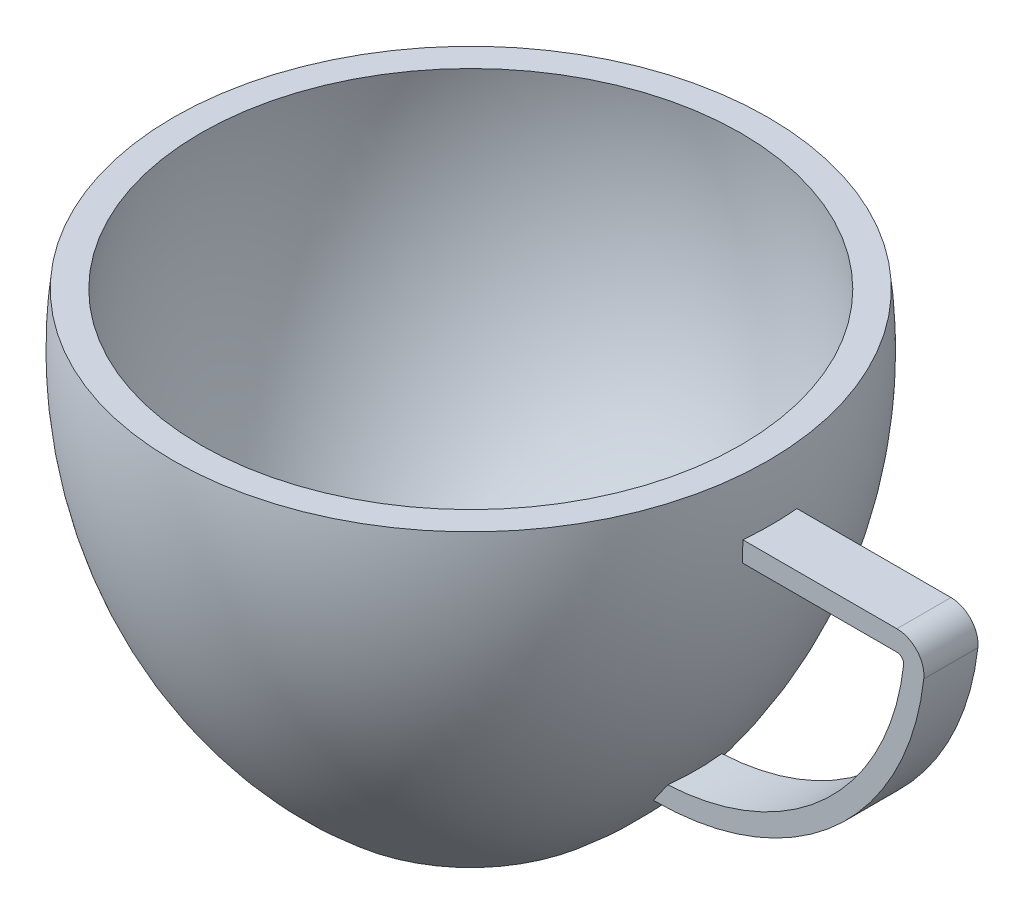
ISO-10303-21;
HEADER;
FILE_DESCRIPTION(('STEP AP214'),'2;1');
FILE_NAME('part.step','',(''),(''),'','','');
FILE_SCHEMA(('AUTOMOTIVE_DESIGN { 1 0 10303 214 1 1 1 1 }'));
ENDSEC;
DATA;
#1=APPLICATION_CONTEXT('core data for automotive mechanical design processes');
#2=APPLICATION_PROTOCOL_DEFINITION('international standard','automotive_design',2000,#1);
#3=PRODUCT_CONTEXT('',#1,'mechanical');
#4=PRODUCT('Part','Part','',(#3));
#5=PRODUCT_RELATED_PRODUCT_CATEGORY('part','',(#4));
#6=PRODUCT_DEFINITION_FORMATION('','',#4);
#7=PRODUCT_DEFINITION_CONTEXT('part definition',#1,'design');
#8=PRODUCT_DEFINITION('design','',#6,#7);
#9=PRODUCT_DEFINITION_SHAPE('','',#8);
#10=(LENGTH_UNIT() NAMED_UNIT(*) SI_UNIT(.MILLI.,.METRE.));
#11=(NAMED_UNIT(*) PLANE_ANGLE_UNIT() SI_UNIT($,.RADIAN.));
#12=(NAMED_UNIT(*) SI_UNIT($,.STERADIAN.) SOLID_ANGLE_UNIT());
#13=UNCERTAINTY_MEASURE_WITH_UNIT(LENGTH_MEASURE(1.E-05),#10,'distance_accuracy_value','');
#14=(GEOMETRIC_REPRESENTATION_CONTEXT(3) GLOBAL_UNCERTAINTY_ASSIGNED_CONTEXT((#13)) GLOBAL_UNIT_ASSIGNED_CONTEXT((#10,
#11,#12)) REPRESENTATION_CONTEXT('',''));
#15=CARTESIAN_POINT('',(0.,0.,0.));
#16=DIRECTION('',(0.,0.,1.));
#17=DIRECTION('',(1.,0.,0.));
#18=AXIS2_PLACEMENT_3D('',#15,#16,#17);
#19=CARTESIAN_POINT('',(0.,13.0553639813713,0.));
#20=DIRECTION('',(0.,-1.,0.));
#21=DIRECTION('',(0.,0.,-1.));
#22=AXIS2_PLACEMENT_3D('',#19,#20,#21);
#23=DEGENERATE_TOROIDAL_SURFACE('',#22,5.88840995342818,17.,.F.);
#24=CARTESIAN_POINT('',(7.30077248417855,23.696917832123,1.));
#25=CARTESIAN_POINT('',(7.59952083440758,23.3282349060073,1.));
#26=CARTESIAN_POINT('',(7.88257192245152,22.9468891533379,1.));
#27=CARTESIAN_POINT('',(8.41551795262124,22.161730402686,1.));
#28=CARTESIAN_POINT('',(8.66541525257299,21.7579190053139,1.));
#29=CARTESIAN_POINT('',(9.13013885620713,20.9309832917285,1.));
#30=CARTESIAN_POINT('',(9.34499458834599,20.5078755670458,1.));
#31=CARTESIAN_POINT('',(9.63999120526881,19.8609382677927,1.));
#32=CARTESIAN_POINT('',(9.73377916187765,19.6432365469166,1.));
#33=CARTESIAN_POINT('',(9.91214777716445,19.2040273336014,1.));
#34=CARTESIAN_POINT('',(9.99672608389787,18.982518885651,1.));
#35=CARTESIAN_POINT('',(10.236477264824,18.3126683996781,1.));
#36=CARTESIAN_POINT('',(10.3775736268376,17.8592047369365,1.));
#37=CARTESIAN_POINT('',(10.6211601230186,16.9420242494255,1.));
#38=CARTESIAN_POINT('',(10.7236502059755,16.4783074110563,1.));
#39=CARTESIAN_POINT('',(10.8479020955305,15.7775925563018,1.));
#40=CARTESIAN_POINT('',(10.8844087263413,15.5431294008161,1.));
#41=CARTESIAN_POINT('',(10.9475307104827,15.0729376622215,1.));
#42=CARTESIAN_POINT('',(10.974148586066,14.8372094173724,1.));
#43=CARTESIAN_POINT('',(11.0391041157384,14.1286173967237,1.));
#44=CARTESIAN_POINT('',(11.0625515575804,13.6543018350093,1.));
#45=CARTESIAN_POINT('',(11.0695447374267,12.7039587862581,1.));
#46=CARTESIAN_POINT('',(11.052965920939,12.2279305699943,1.));
#47=CARTESIAN_POINT('',(10.9797730680935,11.2789434590875,1.));
#48=CARTESIAN_POINT('',(10.9231588360427,10.8059845794587,1.));
#49=CARTESIAN_POINT('',(10.7703054307952,9.86662094214809,1.));
#50=CARTESIAN_POINT('',(10.6740746582702,9.40021481662722,1.));
#51=CARTESIAN_POINT('',(10.4426643360945,8.4771687178842,1.));
#52=CARTESIAN_POINT('',(10.307485036271,8.02052868203966,1.));
#53=CARTESIAN_POINT('',(9.99919003099215,7.12046109096867,1.));
#54=CARTESIAN_POINT('',(9.82609083080824,6.67702788234679,1.));
#55=CARTESIAN_POINT('',(9.44312624110045,5.80632154025281,1.));
#56=CARTESIAN_POINT('',(9.23326013998763,5.37904871974454,1.));
#57=CARTESIAN_POINT('',(8.77791778242741,4.54317245904872,1.));
#58=CARTESIAN_POINT('',(8.53239413576723,4.13459483099434,1.));
#59=CARTESIAN_POINT('',(8.00766882910043,3.33970621380463,1.));
#60=CARTESIAN_POINT('',(7.72846928635782,2.95339382706814,1.));
#61=CARTESIAN_POINT('',(7.13847459869935,2.20607005377405,1.));
#62=CARTESIAN_POINT('',(6.82769874895184,1.84504344114076,1.));
#63=CARTESIAN_POINT('',(6.17645110554574,1.15070607368025,1.));
#64=CARTESIAN_POINT('',(5.83597230816754,0.817401891969589,1.));
#65=CARTESIAN_POINT('',(5.12895362690315,0.18253215559642,1.));
#66=CARTESIAN_POINT('',(4.76252350960286,-0.119155096026248,1.));
#67=CARTESIAN_POINT('',(4.19432413785789,-0.546566062014832,1.));
#68=CARTESIAN_POINT('',(4.00187072838982,-0.684825585846648,1.));
#69=CARTESIAN_POINT('',(3.61095182299595,-0.952547586039068,1.));
#70=CARTESIAN_POINT('',(3.41248733350122,-1.08201152339539,1.));
#71=CARTESIAN_POINT('',(3.07367758736998,-1.29185019407373,1.));
#72=CARTESIAN_POINT('',(2.93489315775723,-1.37475645255763,1.));
#73=CARTESIAN_POINT('',(2.6546023972089,-1.53583567682707,1.));
#74=CARTESIAN_POINT('',(2.51309617982307,-1.61400883950981,1.));
#75=CARTESIAN_POINT('',(2.22668532019009,-1.76543257271358,1.));
#76=CARTESIAN_POINT('',(2.08176861233274,-1.83866035368695,1.));
#77=CARTESIAN_POINT('',(1.78896847151265,-1.97890896755457,1.));
#78=CARTESIAN_POINT('',(1.64108570320917,-2.04593117255011,1.));
#79=CARTESIAN_POINT('',(1.40175161897428,-2.14664876863682,1.));
#80=CARTESIAN_POINT('',(1.31139751655248,-2.18294852778397,1.));
#81=CARTESIAN_POINT('',(1.12928508571877,-2.25181415852131,1.));
#82=CARTESIAN_POINT('',(1.03752709984784,-2.2843809249812,1.));
#83=CARTESIAN_POINT('',(0.853128632707883,-2.34424239735785,1.));
#84=CARTESIAN_POINT('',(0.760501934866983,-2.37157888760958,1.));
#85=CARTESIAN_POINT('',(0.573429199876512,-2.41920484681435,1.));
#86=CARTESIAN_POINT('',(0.478984187164986,-2.439498167952,1.));
#87=CARTESIAN_POINT('',(0.308581230659268,-2.46687648123689,1.));
#88=CARTESIAN_POINT('',(0.232936204022655,-2.47584687972702,1.));
#89=CARTESIAN_POINT('',(0.0811560262776345,-2.48629440331269,1.));
#90=CARTESIAN_POINT('',(0.00502126724677077,-2.48777691858447,1.));
#91=CARTESIAN_POINT('',(-0.147258877175811,-2.48300121892752,1.));
#92=CARTESIAN_POINT('',(-0.223403363894557,-2.47671584562317,1.));
#93=CARTESIAN_POINT('',(-0.374847972516725,-2.45734615858675,1.));
#94=CARTESIAN_POINT('',(-0.450147305380438,-2.44425595671639,1.));
#95=CARTESIAN_POINT('',(-0.615750770504337,-2.40938324519143,1.));
#96=CARTESIAN_POINT('',(-0.705780908854443,-2.38633361058506,1.));
#97=CARTESIAN_POINT('',(-0.884265620633698,-2.33470268860218,1.));
#98=CARTESIAN_POINT('',(-0.972718950361583,-2.30611722887742,1.));
#99=CARTESIAN_POINT('',(-1.14840070648424,-2.24486925955854,1.));
#100=CARTESIAN_POINT('',(-1.23562607025081,-2.21219806669902,1.));
#101=CARTESIAN_POINT('',(-1.40881599856753,-2.14376809508477,1.));
#102=CARTESIAN_POINT('',(-1.49478094194235,-2.10801026724721,1.));
#103=CARTESIAN_POINT('',(-1.66652534860595,-2.03357312269801,1.));
#104=CARTESIAN_POINT('',(-1.75229300458023,-1.99486666068911,1.));
#105=CARTESIAN_POINT('',(-1.92279712624196,-1.91524117380599,1.));
#106=CARTESIAN_POINT('',(-2.0075335182167,-1.87432199189564,1.));
#107=CARTESIAN_POINT('',(-2.26003881615724,-1.74874843082098,1.));
#108=CARTESIAN_POINT('',(-2.42636135232311,-1.66116455766798,1.));
#109=CARTESIAN_POINT('',(-2.65847650303473,-1.53285615075187,1.));
#110=CARTESIAN_POINT('',(-2.72581959625385,-1.49489304711488,1.));
#111=CARTESIAN_POINT('',(-2.85989700748074,-1.41787037298937,1.));
#112=CARTESIAN_POINT('',(-2.92663119448619,-1.37881057359524,1.));
#113=CARTESIAN_POINT('',(-3.05860501398651,-1.30016481565211,1.));
#114=CARTESIAN_POINT('',(-3.12385277025689,-1.26059246888165,1.));
#115=CARTESIAN_POINT('',(-3.25372389196207,-1.18046899608098,1.));
#116=CARTESIAN_POINT('',(-3.31834739746859,-1.13991809711818,1.));
#117=CARTESIAN_POINT('',(-3.38266532388736,-1.09888836325226,1.));
#118=B_SPLINE_CURVE_WITH_KNOTS('',3,(#24,#25,#26,#27,#28,#29,#30,#31,#32,#33,#34,#35,#36,#37,
#38,#39,#40,#41,#42,#43,#44,#45,#46,#47,#48,#49,#50,#51,#52,#53,#54,#55,#56,#57,#58,#59,#60,#61,
#62,#63,#64,#65,#66,#67,#68,#69,#70,#71,#72,#73,#74,#75,#76,#77,#78,#79,#80,#81,#82,#83,#84,#85,
#86,#87,#88,#89,#90,#91,#92,#93,#94,#95,#96,#97,#98,#99,#100,#101,#102,#103,#104,#105,#106,#107,
#108,#109,#110,#111,#112,#113,#114,#115,#116,#117),.UNSPECIFIED.,.F.,.F.,(4,2,2,2,2,2,2,2,2,2,2,
2,2,2,2,2,2,2,2,2,2,2,2,2,2,2,2,2,2,2,2,2,2,2,2,2,2,2,2,2,2,2,2,2,2,2,4),(0.,1.42308373777363,
2.84606621458399,4.26784742533111,4.9788015721496,5.68993685748893,7.11287625441678,
8.53581753883907,9.24749800831132,9.95899682979537,11.3818593264416,12.8091552182209,
14.2364580866638,15.6634584518618,17.0904496640623,18.5168209842246,19.9432199135187,
21.3715322295514,22.7997547917895,24.2271098072258,25.6548022960578,27.0767803160258,
27.7874963493702,28.4980940387345,28.9830014054076,29.4678885860135,29.9548761128751,
30.4417557045654,30.7338161915882,31.02580651906,31.3153566728629,31.6047482098701,
31.8329577921904,32.0610030736902,32.2898479158519,32.5188911051873,32.797431986368,
33.0761836264962,33.3555380897696,33.6348067958012,33.9170609938737,34.1993352498069,
34.7630403879642,34.9949546157702,35.2269176146222,35.4558394974244,35.684708761535),.UNSPECIFIED.);
#119=CARTESIAN_POINT('',(8.28628325742246,3.76181677329364,1.));
#120=VERTEX_POINT('',#119);
#121=CARTESIAN_POINT('',(7.75466331155347,3.,1.));
#122=VERTEX_POINT('',#121);
#123=EDGE_CURVE('E50',#120,#122,#118,.T.);
#124=ORIENTED_EDGE('',*,*,#123,.F.);
#125=CARTESIAN_POINT('',(8.28625828793409,3.76181550998923,-1.0002));
#126=CARTESIAN_POINT('',(8.30702359390765,3.76288343039289,-0.834041800622752));
#127=CARTESIAN_POINT('',(8.32262960677655,3.7637258926403,-0.667233596445798));
#128=CARTESIAN_POINT('',(8.34339842030332,3.76487343385285,-0.333615257628465));
#129=CARTESIAN_POINT('',(8.34860140314498,3.7651805799089,-0.166807628814233));
#130=CARTESIAN_POINT('',(8.34860140314498,3.7651805799089,0.166807628814233));
#131=CARTESIAN_POINT('',(8.34339842030332,3.76487343385285,0.333615257628466));
#132=CARTESIAN_POINT('',(8.32262960677655,3.7637258926403,0.667233596445798));
#133=CARTESIAN_POINT('',(8.30702359390765,3.76288343039289,0.834041800622752));
#134=CARTESIAN_POINT('',(8.28625828793408,3.76181550998922,1.0002));
#135=B_SPLINE_CURVE_WITH_KNOTS('',3,(#125,#126,#127,#128,#129,#130,#131,#132,#133,#134),
.UNSPECIFIED.,.F.,.F.,(4,2,2,2,4),(0.,0.502287912779315,1.00263193813927,1.50297596349923,
2.00526387627855),.UNSPECIFIED.);
#136=CARTESIAN_POINT('',(8.28628325742246,3.76181677329364,-1.));
#137=VERTEX_POINT('',#136);
#138=EDGE_CURVE('E220',#137,#120,#135,.T.);
#139=ORIENTED_EDGE('',*,*,#138,.F.);
#140=CARTESIAN_POINT('',(7.30077248417861,23.6969178321229,-1.));
#141=CARTESIAN_POINT('',(7.59952083440764,23.3282349060072,-1.));
#142=CARTESIAN_POINT('',(7.88257192245157,22.9468891533378,-1.));
#143=CARTESIAN_POINT('',(8.41551795262129,22.1617304026859,-1.));
#144=CARTESIAN_POINT('',(8.66541525257304,21.7579190053138,-1.));
#145=CARTESIAN_POINT('',(9.13013885620717,20.9309832917284,-1.));
#146=CARTESIAN_POINT('',(9.34499458834603,20.5078755670457,-1.));
#147=CARTESIAN_POINT('',(9.63999120526885,19.8609382677926,-1.));
#148=CARTESIAN_POINT('',(9.73377916187768,19.6432365469165,-1.));
#149=CARTESIAN_POINT('',(9.91214777716448,19.2040273336013,-1.));
#150=CARTESIAN_POINT('',(9.99672608389791,18.9825188856509,-1.));
#151=CARTESIAN_POINT('',(10.236477264824,18.312668399678,-1.));
#152=CARTESIAN_POINT('',(10.3775736268376,17.8592047369364,-1.));
#153=CARTESIAN_POINT('',(10.6211601230186,16.9420242494254,-1.));
#154=CARTESIAN_POINT('',(10.7236502059755,16.4783074110562,-1.));
#155=CARTESIAN_POINT('',(10.8479020955305,15.7775925563017,-1.));
#156=CARTESIAN_POINT('',(10.8844087263413,15.543129400816,-1.));
#157=CARTESIAN_POINT('',(10.9475307104827,15.0729376622214,-1.));
#158=CARTESIAN_POINT('',(10.974148586066,14.8372094173723,-1.));
#159=CARTESIAN_POINT('',(11.0391041157384,14.1286173967236,-1.));
#160=CARTESIAN_POINT('',(11.0625515575804,13.6543018350092,-1.));
#161=CARTESIAN_POINT('',(11.0695447374267,12.703958786258,-1.));
#162=CARTESIAN_POINT('',(11.052965920939,12.2279305699942,-1.));
#163=CARTESIAN_POINT('',(10.9797730680935,11.2789434590874,-1.));
#164=CARTESIAN_POINT('',(10.9231588360427,10.8059845794586,-1.));
#165=CARTESIAN_POINT('',(10.7703054307952,9.866620942148,-1.));
#166=CARTESIAN_POINT('',(10.6740746582702,9.40021481662713,-1.));
#167=CARTESIAN_POINT('',(10.4426643360945,8.47716871788411,-1.));
#168=CARTESIAN_POINT('',(10.307485036271,8.02052868203957,-1.));
#169=CARTESIAN_POINT('',(9.99919003099211,7.12046109096858,-1.));
#170=CARTESIAN_POINT('',(9.8260908308082,6.6770278823467,-1.));
#171=CARTESIAN_POINT('',(9.44312624110041,5.80632154025272,-1.));
#172=CARTESIAN_POINT('',(9.23326013998758,5.37904871974445,-1.));
#173=CARTESIAN_POINT('',(8.77791778242737,4.54317245904864,-1.));
#174=CARTESIAN_POINT('',(8.53239413576718,4.13459483099426,-1.));
#175=CARTESIAN_POINT('',(8.00766882910037,3.33970621380455,-1.));
#176=CARTESIAN_POINT('',(7.72846928635776,2.95339382706806,-1.));
#177=CARTESIAN_POINT('',(7.1384745986993,2.20607005377398,-1.));
#178=CARTESIAN_POINT('',(6.82769874895178,1.84504344114069,-1.));
#179=CARTESIAN_POINT('',(6.17645110554567,1.15070607368019,-1.));
#180=CARTESIAN_POINT('',(5.83597230816748,0.817401891969525,-1.));
#181=CARTESIAN_POINT('',(5.12895362690308,0.182532155596356,-1.));
#182=CARTESIAN_POINT('',(4.76252350960279,-0.119155096026313,-1.));
#183=CARTESIAN_POINT('',(4.19432413785782,-0.546566062014888,-1.));
#184=CARTESIAN_POINT('',(4.00187072838974,-0.6848255858467,-1.));
#185=CARTESIAN_POINT('',(3.61095182299587,-0.952547586039116,-1.));
#186=CARTESIAN_POINT('',(3.41248733350115,-1.08201152339544,-1.));
#187=CARTESIAN_POINT('',(3.0736775873699,-1.29185019407378,-1.));
#188=CARTESIAN_POINT('',(2.93489315775716,-1.37475645255767,-1.));
#189=CARTESIAN_POINT('',(2.65460239720883,-1.53583567682711,-1.));
#190=CARTESIAN_POINT('',(2.513096179823,-1.61400883950984,-1.));
#191=CARTESIAN_POINT('',(2.22668532019003,-1.76543257271362,-1.));
#192=CARTESIAN_POINT('',(2.08176861233267,-1.83866035368698,-1.));
#193=CARTESIAN_POINT('',(1.78896847151259,-1.9789089675546,-1.));
#194=CARTESIAN_POINT('',(1.64108570320911,-2.04593117255013,-1.));
#195=CARTESIAN_POINT('',(1.40175161897423,-2.14664876863685,-1.));
#196=CARTESIAN_POINT('',(1.31139751655243,-2.18294852778399,-1.));
#197=CARTESIAN_POINT('',(1.12928508571872,-2.25181415852133,-1.));
#198=CARTESIAN_POINT('',(1.03752709984779,-2.28438092498122,-1.));
#199=CARTESIAN_POINT('',(0.853128632707842,-2.34424239735786,-1.));
#200=CARTESIAN_POINT('',(0.760501934866944,-2.37157888760959,-1.));
#201=CARTESIAN_POINT('',(0.573429199876475,-2.41920484681436,-1.));
#202=CARTESIAN_POINT('',(0.478984187164949,-2.439498167952,-1.));
#203=CARTESIAN_POINT('',(0.30858123065923,-2.4668764812369,-1.));
#204=CARTESIAN_POINT('',(0.232936204022615,-2.47584687972702,-1.));
#205=CARTESIAN_POINT('',(0.0811560262775907,-2.48629440331269,-1.));
#206=CARTESIAN_POINT('',(0.00502126724672663,-2.48777691858447,-1.));
#207=CARTESIAN_POINT('',(-0.147258877175855,-2.48300121892751,-1.));
#208=CARTESIAN_POINT('',(-0.223403363894601,-2.47671584562316,-1.));
#209=CARTESIAN_POINT('',(-0.374847972516767,-2.45734615858674,-1.));
#210=CARTESIAN_POINT('',(-0.450147305380478,-2.44425595671638,-1.));
#211=CARTESIAN_POINT('',(-0.615750770504377,-2.40938324519142,-1.));
#212=CARTESIAN_POINT('',(-0.705780908854484,-2.38633361058505,-1.));
#213=CARTESIAN_POINT('',(-0.884265620633748,-2.33470268860216,-1.));
#214=CARTESIAN_POINT('',(-0.972718950361639,-2.30611722887741,-1.));
#215=CARTESIAN_POINT('',(-1.14840070648431,-2.24486925955852,-1.));
#216=CARTESIAN_POINT('',(-1.23562607025089,-2.21219806669899,-1.));
#217=CARTESIAN_POINT('',(-1.40881599856762,-2.14376809508473,-1.));
#218=CARTESIAN_POINT('',(-1.49478094194244,-2.10801026724717,-1.));
#219=CARTESIAN_POINT('',(-1.66652534860605,-2.03357312269796,-1.));
#220=CARTESIAN_POINT('',(-1.75229300458034,-1.99486666068907,-1.));
#221=CARTESIAN_POINT('',(-1.92279712624208,-1.91524117380594,-1.));
#222=CARTESIAN_POINT('',(-2.00753351821682,-1.87432199189559,-1.));
#223=CARTESIAN_POINT('',(-2.26003881615737,-1.74874843082091,-1.));
#224=CARTESIAN_POINT('',(-2.42636135232325,-1.66116455766791,-1.));
#225=CARTESIAN_POINT('',(-2.65847650303485,-1.5328561507518,-1.));
#226=CARTESIAN_POINT('',(-2.72581959625396,-1.49489304711482,-1.));
#227=CARTESIAN_POINT('',(-2.85989700748083,-1.41787037298932,-1.));
#228=CARTESIAN_POINT('',(-2.92663119448626,-1.3788105735952,-1.));
#229=CARTESIAN_POINT('',(-3.05860501398656,-1.30016481565208,-1.));
#230=CARTESIAN_POINT('',(-3.12385277025693,-1.26059246888162,-1.));
#231=CARTESIAN_POINT('',(-3.25372389196209,-1.18046899608096,-1.));
#232=CARTESIAN_POINT('',(-3.3183473974686,-1.13991809711817,-1.));
#233=CARTESIAN_POINT('',(-3.38266532388736,-1.09888836325226,-1.));
#234=B_SPLINE_CURVE_WITH_KNOTS('',3,(#140,#141,#142,#143,#144,#145,#146,#147,#148,#149,#150,
#151,#152,#153,#154,#155,#156,#157,#158,#159,#160,#161,#162,#163,#164,#165,#166,#167,#168,#169,
#170,#171,#172,#173,#174,#175,#176,#177,#178,#179,#180,#181,#182,#183,#184,#185,#186,#187,#188,
#189,#190,#191,#192,#193,#194,#195,#196,#197,#198,#199,#200,#201,#202,#203,#204,#205,#206,#207,
#208,#209,#210,#211,#212,#213,#214,#215,#216,#217,#218,#219,#220,#221,#222,#223,#224,#225,#226,
#227,#228,#229,#230,#231,#232,#233),.UNSPECIFIED.,.F.,.F.,(4,2,2,2,2,2,2,2,2,2,2,2,2,2,2,2,2,2,
2,2,2,2,2,2,2,2,2,2,2,2,2,2,2,2,2,2,2,2,2,2,2,2,2,2,2,2,4),(0.,1.42308373777364,
2.84606621458399,4.26784742533111,4.97880157214961,5.68993685748894,7.11287625441679,
8.53581753883909,9.24749800831133,9.95899682979538,11.3818593264416,12.8091552182209,
14.2364580866638,15.6634584518618,17.0904496640623,18.5168209842246,19.9432199135188,
21.3715322295515,22.7997547917895,24.2271098072258,25.6548022960578,27.0767803160258,
27.7874963493702,28.4980940387345,28.9830014054076,29.4678885860135,29.9548761128751,
30.4417557045654,30.7338161915882,31.0258065190599,31.3153566728629,31.60474820987,
31.8329577921903,32.0610030736902,32.2898479158519,32.5188911051873,32.797431986368,
33.0761836264962,33.3555380897696,33.6348067958012,33.9170609938737,34.1993352498069,
34.7630403879643,34.9949546157702,35.2269176146222,35.4558394974243,35.6847087615349),.UNSPECIFIED.);
#235=CARTESIAN_POINT('',(7.75466331156696,3.00000000000911,-1.));
#236=VERTEX_POINT('',#235);
#237=EDGE_CURVE('E208',#137,#236,#234,.T.);
#238=ORIENTED_EDGE('',*,*,#237,.T.);
#239=CARTESIAN_POINT('',(0.,3.,0.));
#240=DIRECTION('',(0.,-1.,0.));
#241=DIRECTION('',(1.,0.,0.));
#242=AXIS2_PLACEMENT_3D('',#239,#240,#241);
#243=CIRCLE('',#242,7.81887479600858);
#244=CARTESIAN_POINT('',(7.81887479600857,3.,0.));
#245=VERTEX_POINT('',#244);
#246=EDGE_CURVE('E302',#236,#245,#243,.T.);
#247=ORIENTED_EDGE('',*,*,#246,.T.);
#248=EDGE_CURVE('E120',#245,#122,#243,.T.);
#249=ORIENTED_EDGE('',*,*,#248,.T.);
#250=EDGE_LOOP('',(#124,#139,#238,#247,#249));
#251=FACE_BOUND('',#250,.T.);
#252=CARTESIAN_POINT('',(0.,0.,0.));
#253=DIRECTION('',(0.,-1.,0.));
#254=DIRECTION('',(0.,0.,-1.));
#255=AXIS2_PLACEMENT_3D('',#252,#253,#254);
#256=CIRCLE('',#255,4.99999999999999);
#257=CARTESIAN_POINT('',(0.,0.,-4.99999999999999));
#258=VERTEX_POINT('',#257);
#259=EDGE_CURVE('E204',#258,#258,#256,.T.);
#260=ORIENTED_EDGE('',*,*,#259,.F.);
#261=EDGE_LOOP('',(#260));
#262=FACE_BOUND('',#261,.T.);
#263=CARTESIAN_POINT('',(0.,15.,0.));
#264=DIRECTION('',(0.,-1.,0.));
#265=DIRECTION('',(0.,0.,-1.));
#266=AXIS2_PLACEMENT_3D('',#263,#264,#265);
#267=CIRCLE('',#266,11.);
#268=CARTESIAN_POINT('',(0.,15.,-11.));
#269=VERTEX_POINT('',#268);
#270=EDGE_CURVE('E200',#269,#269,#267,.T.);
#271=ORIENTED_EDGE('',*,*,#270,.T.);
#272=EDGE_LOOP('',(#271));
#273=FACE_BOUND('',#272,.T.);
#274=CARTESIAN_POINT('',(11.0664099824725,13.,1.));
#275=VERTEX_POINT('',#274);
#276=CARTESIAN_POINT('',(11.0473350829655,12.25,1.));
#277=VERTEX_POINT('',#276);
#278=EDGE_CURVE('E11',#275,#277,#118,.T.);
#279=ORIENTED_EDGE('',*,*,#278,.F.);
#280=CARTESIAN_POINT('',(0.,13.,0.));
#281=DIRECTION('',(0.,1.,0.));
#282=DIRECTION('',(-1.,0.,0.));
#283=AXIS2_PLACEMENT_3D('',#280,#281,#282);
#284=CIRCLE('',#283,11.1114998942612);
#285=CARTESIAN_POINT('',(11.0664099824725,13.,-1.));
#286=VERTEX_POINT('',#285);
#287=EDGE_CURVE('E43',#275,#286,#284,.T.);
#288=ORIENTED_EDGE('',*,*,#287,.T.);
#289=CARTESIAN_POINT('',(11.047335082967,12.2500000000309,-1.));
#290=VERTEX_POINT('',#289);
#291=EDGE_CURVE('E221',#286,#290,#234,.T.);
#292=ORIENTED_EDGE('',*,*,#291,.T.);
#293=CARTESIAN_POINT('',(0.,12.25,0.));
#294=DIRECTION('',(0.,1.,0.));
#295=DIRECTION('',(-1.,0.,0.));
#296=AXIS2_PLACEMENT_3D('',#293,#294,#295);
#297=CIRCLE('',#296,11.0925025325812);
#298=EDGE_CURVE('E294',#277,#290,#297,.T.);
#299=ORIENTED_EDGE('',*,*,#298,.F.);
#300=EDGE_LOOP('',(#279,#288,#292,#299));
#301=FACE_BOUND('',#300,.T.);
#302=ADVANCED_FACE('F39',(#251,#262,#273,#301),#23,.F.);
#303=CARTESIAN_POINT('',(0.,0.,0.));
#304=DIRECTION('',(0.,1.,0.));
#305=DIRECTION('',(0.,0.,1.));
#306=AXIS2_PLACEMENT_3D('',#303,#304,#305);
#307=PLANE('',#306);
#308=ORIENTED_EDGE('',*,*,#259,.T.);
#309=EDGE_LOOP('',(#308));
#310=FACE_BOUND('',#309,.T.);
#311=ADVANCED_FACE('F41',(#310),#307,.F.);
#312=CARTESIAN_POINT('',(-11.,15.,0.));
#313=DIRECTION('',(0.,-1.,0.));
#314=DIRECTION('',(0.,0.,-1.));
#315=AXIS2_PLACEMENT_3D('',#312,#313,#314);
#316=PLANE('',#315);
#317=CARTESIAN_POINT('',(0.,15.,0.));
#318=DIRECTION('',(0.,-1.,0.));
#319=DIRECTION('',(0.,0.,-1.));
#320=AXIS2_PLACEMENT_3D('',#317,#318,#319);
#321=CIRCLE('',#320,9.99297508551133);
#322=CARTESIAN_POINT('',(0.,15.,-9.99297508551133));
#323=VERTEX_POINT('',#322);
#324=EDGE_CURVE('E199',#323,#323,#321,.F.);
#325=ORIENTED_EDGE('',*,*,#324,.F.);
#326=EDGE_LOOP('',(#325));
#327=FACE_BOUND('',#326,.T.);
#328=ORIENTED_EDGE('',*,*,#270,.F.);
#329=EDGE_LOOP('',(#328));
#330=FACE_BOUND('',#329,.T.);
#331=ADVANCED_FACE('F268',(#327,#330),#316,.F.);
#332=CARTESIAN_POINT('',(0.,13.0553639813713,0.));
#333=DIRECTION('',(0.,-1.,0.));
#334=DIRECTION('',(0.,0.,-1.));
#335=AXIS2_PLACEMENT_3D('',#332,#333,#334);
#336=DEGENERATE_TOROIDAL_SURFACE('',#335,5.88840995342818,16.,.F.);
#337=CARTESIAN_POINT('',(0.,0.999999999999996,0.));
#338=DIRECTION('',(0.,-1.,0.));
#339=DIRECTION('',(0.,0.,-1.));
#340=AXIS2_PLACEMENT_3D('',#337,#338,#339);
#341=CIRCLE('',#340,4.63148544893472);
#342=CARTESIAN_POINT('',(0.,0.999999999999996,-4.63148544893472));
#343=VERTEX_POINT('',#342);
#344=EDGE_CURVE('E126',#343,#343,#341,.T.);
#345=ORIENTED_EDGE('',*,*,#344,.T.);
#346=EDGE_LOOP('',(#345));
#347=FACE_BOUND('',#346,.T.);
#348=ORIENTED_EDGE('',*,*,#324,.T.);
#349=EDGE_LOOP('',(#348));
#350=FACE_BOUND('',#349,.T.);
#351=ADVANCED_FACE('F265',(#347,#350),#336,.T.);
#352=CARTESIAN_POINT('',(0.,0.999999999999996,0.));
#353=DIRECTION('',(0.,1.,0.));
#354=DIRECTION('',(0.,0.,1.));
#355=AXIS2_PLACEMENT_3D('',#352,#353,#354);
#356=PLANE('',#355);
#357=ORIENTED_EDGE('',*,*,#344,.F.);
#358=EDGE_LOOP('',(#357));
#359=FACE_BOUND('',#358,.T.);
#360=ADVANCED_FACE('F262',(#359),#356,.T.);
#361=CARTESIAN_POINT('',(7.81887479600857,3.,1.));
#362=DIRECTION('',(0.,-1.,0.));
#363=DIRECTION('',(1.,0.,0.));
#364=AXIS2_PLACEMENT_3D('',#361,#362,#363);
#365=PLANE('',#364);
#366=ORIENTED_EDGE('',*,*,#248,.F.);
#367=DIRECTION('',(0.,0.,-1.));
#368=VECTOR('',#367,1.);
#369=CARTESIAN_POINT('',(7.81887479600857,3.,1.));
#370=LINE('',#369,#368);
#371=CARTESIAN_POINT('',(7.81887479600857,3.,1.));
#372=VERTEX_POINT('',#371);
#373=EDGE_CURVE('E115',#372,#245,#370,.T.);
#374=ORIENTED_EDGE('',*,*,#373,.F.);
#375=DIRECTION('',(-1.,0.,0.));
#376=VECTOR('',#375,1.);
#377=CARTESIAN_POINT('',(7.81887479600857,3.,1.));
#378=LINE('',#377,#376);
#379=EDGE_CURVE('E118',#372,#122,#378,.T.);
#380=ORIENTED_EDGE('',*,*,#379,.T.);
#381=EDGE_LOOP('',(#366,#374,#380));
#382=FACE_BOUND('',#381,.T.);
#383=ADVANCED_FACE('F117',(#382),#365,.T.);
#384=CARTESIAN_POINT('',(7.81887479600857,13.,1.));
#385=DIRECTION('',(0.,0.,-1.));
#386=DIRECTION('',(-1.,0.,0.));
#387=AXIS2_PLACEMENT_3D('',#384,#385,#386);
#388=CYLINDRICAL_SURFACE('',#387,9.25);
#389=CARTESIAN_POINT('',(7.81887479600857,13.,-1.));
#390=DIRECTION('',(0.,0.,1.));
#391=DIRECTION('',(1.,0.,0.));
#392=AXIS2_PLACEMENT_3D('',#389,#390,#391);
#393=CIRCLE('',#392,9.25);
#394=CARTESIAN_POINT('',(17.0115987035077,11.9722222222222,-1.));
#395=VERTEX_POINT('',#394);
#396=EDGE_CURVE('E139',#395,#137,#393,.F.);
#397=ORIENTED_EDGE('',*,*,#396,.T.);
#398=ORIENTED_EDGE('',*,*,#138,.T.);
#399=CARTESIAN_POINT('',(7.81887479600857,13.,1.));
#400=DIRECTION('',(0.,0.,1.));
#401=DIRECTION('',(1.,0.,0.));
#402=AXIS2_PLACEMENT_3D('',#399,#400,#401);
#403=CIRCLE('',#402,9.25);
#404=CARTESIAN_POINT('',(17.0115987035077,11.9722222222222,1.));
#405=VERTEX_POINT('',#404);
#406=EDGE_CURVE('E159',#405,#120,#403,.F.);
#407=ORIENTED_EDGE('',*,*,#406,.F.);
#408=DIRECTION('',(0.,0.,-1.));
#409=VECTOR('',#408,1.);
#410=CARTESIAN_POINT('',(17.0115987035077,11.9722222222222,1.));
#411=LINE('',#410,#409);
#412=EDGE_CURVE('E162',#405,#395,#411,.T.);
#413=ORIENTED_EDGE('',*,*,#412,.T.);
#414=EDGE_LOOP('',(#397,#398,#407,#413));
#415=FACE_BOUND('',#414,.T.);
#416=ADVANCED_FACE('F236',(#415),#388,.F.);
#417=CARTESIAN_POINT('',(7.81887479600857,13.,1.));
#418=DIRECTION('',(0.,0.,-1.));
#419=DIRECTION('',(-1.,0.,0.));
#420=AXIS2_PLACEMENT_3D('',#417,#418,#419);
#421=PLANE('',#420);
#422=DIRECTION('',(1.,0.,0.));
#423=VECTOR('',#422,1.);
#424=CARTESIAN_POINT('',(10.5,13.,1.));
#425=LINE('',#424,#423);
#426=CARTESIAN_POINT('',(16.7631467060077,13.,1.));
#427=VERTEX_POINT('',#426);
#428=EDGE_CURVE('E148',#275,#427,#425,.T.);
#429=ORIENTED_EDGE('',*,*,#428,.F.);
#430=ORIENTED_EDGE('',*,*,#278,.T.);
#431=DIRECTION('',(1.,0.,0.));
#432=VECTOR('',#431,1.);
#433=CARTESIAN_POINT('',(10.5,12.25,1.));
#434=LINE('',#433,#432);
#435=CARTESIAN_POINT('',(16.7631467060077,12.25,1.));
#436=VERTEX_POINT('',#435);
#437=EDGE_CURVE('E153',#277,#436,#434,.T.);
#438=ORIENTED_EDGE('',*,*,#437,.T.);
#439=CARTESIAN_POINT('',(16.7631467060077,12.,1.));
#440=DIRECTION('',(0.,0.,1.));
#441=DIRECTION('',(1.,0.,0.));
#442=AXIS2_PLACEMENT_3D('',#439,#440,#441);
#443=CIRCLE('',#442,0.250000000000001);
#444=EDGE_CURVE('E156',#436,#405,#443,.F.);
#445=ORIENTED_EDGE('',*,*,#444,.T.);
#446=ORIENTED_EDGE('',*,*,#406,.T.);
#447=ORIENTED_EDGE('',*,*,#123,.T.);
#448=ORIENTED_EDGE('',*,*,#379,.F.);
#449=CARTESIAN_POINT('',(7.81887479600857,13.,1.));
#450=DIRECTION('',(0.,0.,-1.));
#451=DIRECTION('',(-1.,0.,0.));
#452=AXIS2_PLACEMENT_3D('',#449,#450,#451);
#453=CIRCLE('',#452,10.);
#454=CARTESIAN_POINT('',(17.7569546960076,11.8888888888889,1.));
#455=VERTEX_POINT('',#454);
#456=EDGE_CURVE('E134',#455,#372,#453,.T.);
#457=ORIENTED_EDGE('',*,*,#456,.F.);
#458=CARTESIAN_POINT('',(16.7631467060077,12.,1.));
#459=DIRECTION('',(0.,0.,-1.));
#460=DIRECTION('',(-1.,0.,0.));
#461=AXIS2_PLACEMENT_3D('',#458,#459,#460);
#462=CIRCLE('',#461,1.);
#463=EDGE_CURVE('E145',#427,#455,#462,.T.);
#464=ORIENTED_EDGE('',*,*,#463,.F.);
#465=EDGE_LOOP('',(#429,#430,#438,#445,#446,#447,#448,#457,#464));
#466=FACE_BOUND('',#465,.T.);
#467=ADVANCED_FACE('F132',(#466),#421,.F.);
#468=CARTESIAN_POINT('',(7.81887479600857,13.,-1.));
#469=DIRECTION('',(0.,0.,-1.));
#470=DIRECTION('',(-1.,0.,0.));
#471=AXIS2_PLACEMENT_3D('',#468,#469,#470);
#472=PLANE('',#471);
#473=ORIENTED_EDGE('',*,*,#291,.F.);
#474=DIRECTION('',(1.,0.,0.));
#475=VECTOR('',#474,1.);
#476=CARTESIAN_POINT('',(10.5,13.,-1.));
#477=LINE('',#476,#475);
#478=CARTESIAN_POINT('',(16.7631467060077,13.,-1.));
#479=VERTEX_POINT('',#478);
#480=EDGE_CURVE('E172',#286,#479,#477,.T.);
#481=ORIENTED_EDGE('',*,*,#480,.T.);
#482=CARTESIAN_POINT('',(16.7631467060077,12.,-1.));
#483=DIRECTION('',(0.,0.,-1.));
#484=DIRECTION('',(-1.,0.,0.));
#485=AXIS2_PLACEMENT_3D('',#482,#483,#484);
#486=CIRCLE('',#485,1.);
#487=CARTESIAN_POINT('',(17.7569546960076,11.8888888888889,-1.));
#488=VERTEX_POINT('',#487);
#489=EDGE_CURVE('E168',#479,#488,#486,.T.);
#490=ORIENTED_EDGE('',*,*,#489,.T.);
#491=CARTESIAN_POINT('',(7.81887479600857,13.,-1.));
#492=DIRECTION('',(0.,0.,-1.));
#493=DIRECTION('',(-1.,0.,0.));
#494=AXIS2_PLACEMENT_3D('',#491,#492,#493);
#495=CIRCLE('',#494,10.);
#496=CARTESIAN_POINT('',(7.81887479600857,3.,-1.));
#497=VERTEX_POINT('',#496);
#498=EDGE_CURVE('E165',#488,#497,#495,.T.);
#499=ORIENTED_EDGE('',*,*,#498,.T.);
#500=DIRECTION('',(-1.,0.,0.));
#501=VECTOR('',#500,1.);
#502=CARTESIAN_POINT('',(7.81887479600857,3.,-1.));
#503=LINE('',#502,#501);
#504=EDGE_CURVE('E64',#497,#236,#503,.T.);
#505=ORIENTED_EDGE('',*,*,#504,.T.);
#506=ORIENTED_EDGE('',*,*,#237,.F.);
#507=ORIENTED_EDGE('',*,*,#396,.F.);
#508=CARTESIAN_POINT('',(16.7631467060077,12.,-1.));
#509=DIRECTION('',(0.,0.,1.));
#510=DIRECTION('',(1.,0.,0.));
#511=AXIS2_PLACEMENT_3D('',#508,#509,#510);
#512=CIRCLE('',#511,0.250000000000001);
#513=CARTESIAN_POINT('',(16.7631467060077,12.25,-1.));
#514=VERTEX_POINT('',#513);
#515=EDGE_CURVE('E177',#514,#395,#512,.F.);
#516=ORIENTED_EDGE('',*,*,#515,.F.);
#517=DIRECTION('',(1.,0.,0.));
#518=VECTOR('',#517,1.);
#519=CARTESIAN_POINT('',(10.5,12.25,-1.));
#520=LINE('',#519,#518);
#521=EDGE_CURVE('E57',#290,#514,#520,.T.);
#522=ORIENTED_EDGE('',*,*,#521,.F.);
#523=EDGE_LOOP('',(#473,#481,#490,#499,#505,#506,#507,#516,#522));
#524=FACE_BOUND('',#523,.T.);
#525=ADVANCED_FACE('F230',(#524),#472,.T.);
#526=ORIENTED_EDGE('',*,*,#246,.F.);
#527=ORIENTED_EDGE('',*,*,#504,.F.);
#528=EDGE_CURVE('E127',#245,#497,#370,.T.);
#529=ORIENTED_EDGE('',*,*,#528,.F.);
#530=EDGE_LOOP('',(#526,#527,#529));
#531=FACE_BOUND('',#530,.T.);
#532=ADVANCED_FACE('F234',(#531),#365,.T.);
#533=CARTESIAN_POINT('',(7.81887479600857,13.,1.));
#534=DIRECTION('',(0.,0.,-1.));
#535=DIRECTION('',(-1.,0.,0.));
#536=AXIS2_PLACEMENT_3D('',#533,#534,#535);
#537=CYLINDRICAL_SURFACE('',#536,10.);
#538=ORIENTED_EDGE('',*,*,#498,.F.);
#539=DIRECTION('',(0.,0.,-1.));
#540=VECTOR('',#539,1.);
#541=CARTESIAN_POINT('',(17.7569546960076,11.8888888888889,1.));
#542=LINE('',#541,#540);
#543=EDGE_CURVE('E143',#455,#488,#542,.T.);
#544=ORIENTED_EDGE('',*,*,#543,.F.);
#545=ORIENTED_EDGE('',*,*,#456,.T.);
#546=ORIENTED_EDGE('',*,*,#373,.T.);
#547=ORIENTED_EDGE('',*,*,#528,.T.);
#548=EDGE_LOOP('',(#538,#544,#545,#546,#547));
#549=FACE_BOUND('',#548,.T.);
#550=ADVANCED_FACE('F142',(#549),#537,.T.);
#551=CARTESIAN_POINT('',(16.7631467060077,12.,1.));
#552=DIRECTION('',(0.,0.,-1.));
#553=DIRECTION('',(-1.,0.,0.));
#554=AXIS2_PLACEMENT_3D('',#551,#552,#553);
#555=CYLINDRICAL_SURFACE('',#554,1.);
#556=ORIENTED_EDGE('',*,*,#489,.F.);
#557=DIRECTION('',(0.,0.,-1.));
#558=VECTOR('',#557,1.);
#559=CARTESIAN_POINT('',(16.7631467060077,13.,1.));
#560=LINE('',#559,#558);
#561=EDGE_CURVE('E190',#427,#479,#560,.T.);
#562=ORIENTED_EDGE('',*,*,#561,.F.);
#563=ORIENTED_EDGE('',*,*,#463,.T.);
#564=ORIENTED_EDGE('',*,*,#543,.T.);
#565=EDGE_LOOP('',(#556,#562,#563,#564));
#566=FACE_BOUND('',#565,.T.);
#567=ADVANCED_FACE('F252',(#566),#555,.T.);
#568=CARTESIAN_POINT('',(10.5,13.,1.));
#569=DIRECTION('',(0.,1.,0.));
#570=DIRECTION('',(-1.,0.,0.));
#571=AXIS2_PLACEMENT_3D('',#568,#569,#570);
#572=PLANE('',#571);
#573=ORIENTED_EDGE('',*,*,#287,.F.);
#574=ORIENTED_EDGE('',*,*,#428,.T.);
#575=ORIENTED_EDGE('',*,*,#561,.T.);
#576=ORIENTED_EDGE('',*,*,#480,.F.);
#577=EDGE_LOOP('',(#573,#574,#575,#576));
#578=FACE_BOUND('',#577,.T.);
#579=ADVANCED_FACE('F248',(#578),#572,.T.);
#580=CARTESIAN_POINT('',(10.5,12.25,1.));
#581=DIRECTION('',(0.,1.,0.));
#582=DIRECTION('',(-1.,0.,0.));
#583=AXIS2_PLACEMENT_3D('',#580,#581,#582);
#584=PLANE('',#583);
#585=ORIENTED_EDGE('',*,*,#437,.F.);
#586=ORIENTED_EDGE('',*,*,#298,.T.);
#587=ORIENTED_EDGE('',*,*,#521,.T.);
#588=DIRECTION('',(0.,0.,-1.));
#589=VECTOR('',#588,1.);
#590=CARTESIAN_POINT('',(16.7631467060077,12.25,1.));
#591=LINE('',#590,#589);
#592=EDGE_CURVE('E186',#436,#514,#591,.T.);
#593=ORIENTED_EDGE('',*,*,#592,.F.);
#594=EDGE_LOOP('',(#585,#586,#587,#593));
#595=FACE_BOUND('',#594,.T.);
#596=ADVANCED_FACE('F244',(#595),#584,.F.);
#597=CARTESIAN_POINT('',(16.7631467060077,12.,1.));
#598=DIRECTION('',(0.,0.,-1.));
#599=DIRECTION('',(-1.,0.,0.));
#600=AXIS2_PLACEMENT_3D('',#597,#598,#599);
#601=CYLINDRICAL_SURFACE('',#600,0.250000000000001);
#602=ORIENTED_EDGE('',*,*,#515,.T.);
#603=ORIENTED_EDGE('',*,*,#412,.F.);
#604=ORIENTED_EDGE('',*,*,#444,.F.);
#605=ORIENTED_EDGE('',*,*,#592,.T.);
#606=EDGE_LOOP('',(#602,#603,#604,#605));
#607=FACE_BOUND('',#606,.T.);
#608=ADVANCED_FACE('F241',(#607),#601,.F.);
#609=CLOSED_SHELL('',(#302,#311,#331,#351,#360,#383,#416,#467,#525,#532,#550,#567,#579,#596,#608));
#610=MANIFOLD_SOLID_BREP('B2',#609);
#611=ADVANCED_BREP_SHAPE_REPRESENTATION('',(#18,#610),#14);
#612=SHAPE_DEFINITION_REPRESENTATION(#9,#611);
ENDSEC;
END-ISO-10303-21;
